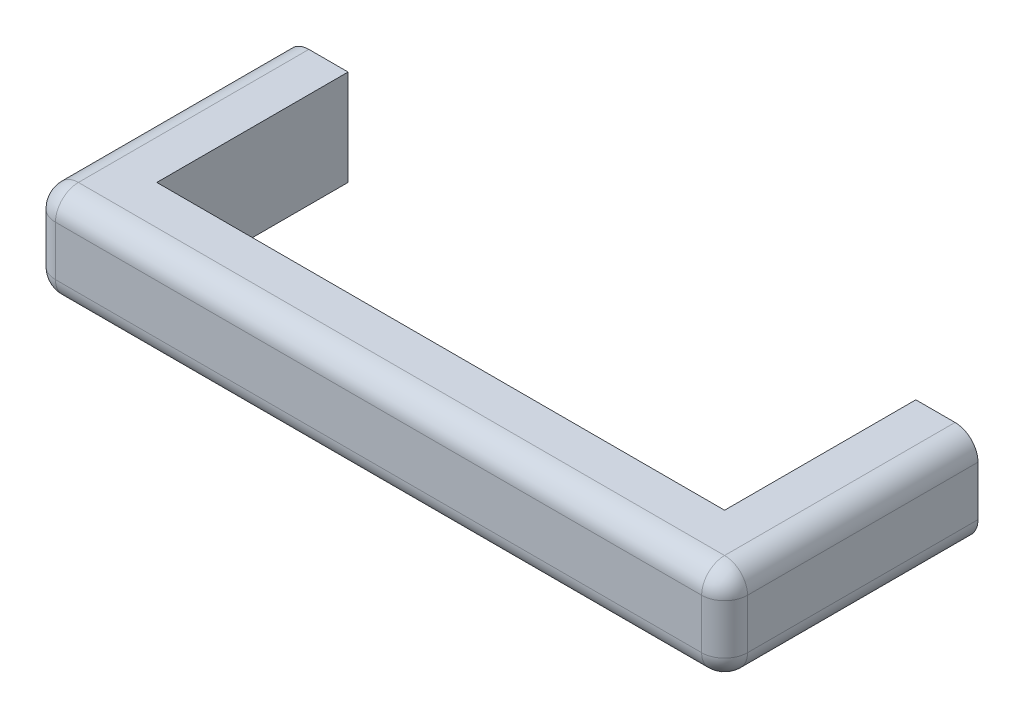
ISO-10303-21;
HEADER;
FILE_DESCRIPTION(('STEP AP214'),'2;1');
FILE_NAME('part.step','',(''),(''),'','','');
FILE_SCHEMA(('AUTOMOTIVE_DESIGN { 1 0 10303 214 1 1 1 1 }'));
ENDSEC;
DATA;
#1=APPLICATION_CONTEXT('core data for automotive mechanical design processes');
#2=APPLICATION_PROTOCOL_DEFINITION('international standard','automotive_design',2000,#1);
#3=PRODUCT_CONTEXT('',#1,'mechanical');
#4=PRODUCT('Part','Part','',(#3));
#5=PRODUCT_RELATED_PRODUCT_CATEGORY('part','',(#4));
#6=PRODUCT_DEFINITION_FORMATION('','',#4);
#7=PRODUCT_DEFINITION_CONTEXT('part definition',#1,'design');
#8=PRODUCT_DEFINITION('design','',#6,#7);
#9=PRODUCT_DEFINITION_SHAPE('','',#8);
#10=(LENGTH_UNIT() NAMED_UNIT(*) SI_UNIT(.MILLI.,.METRE.));
#11=(NAMED_UNIT(*) PLANE_ANGLE_UNIT() SI_UNIT($,.RADIAN.));
#12=(NAMED_UNIT(*) SI_UNIT($,.STERADIAN.) SOLID_ANGLE_UNIT());
#13=UNCERTAINTY_MEASURE_WITH_UNIT(LENGTH_MEASURE(1.E-05),#10,'distance_accuracy_value','');
#14=(GEOMETRIC_REPRESENTATION_CONTEXT(3) GLOBAL_UNCERTAINTY_ASSIGNED_CONTEXT((#13)) GLOBAL_UNIT_ASSIGNED_CONTEXT((#10,
#11,#12)) REPRESENTATION_CONTEXT('',''));
#15=CARTESIAN_POINT('',(0.,0.,0.));
#16=DIRECTION('',(0.,0.,1.));
#17=DIRECTION('',(1.,0.,0.));
#18=AXIS2_PLACEMENT_3D('',#15,#16,#17);
#19=CARTESIAN_POINT('',(376.9999953,-65.0875,-254.));
#20=DIRECTION('',(-1.,0.,0.));
#21=DIRECTION('',(0.,0.,1.));
#22=AXIS2_PLACEMENT_3D('',#19,#20,#21);
#23=PLANE('',#22);
#24=DIRECTION('',(0.,1.,0.));
#25=VECTOR('',#24,1.);
#26=CARTESIAN_POINT('',(376.9999953,-65.0875,-1.38017691961571E-13));
#27=LINE('',#26,#25);
#28=CARTESIAN_POINT('',(376.9999953,-65.0875,-1.38017691961571E-13));
#29=VERTEX_POINT('',#28);
#30=CARTESIAN_POINT('',(376.9999953,61.9125,-1.38017691961571E-13));
#31=VERTEX_POINT('',#30);
#32=EDGE_CURVE('E134',#29,#31,#27,.T.);
#33=ORIENTED_EDGE('',*,*,#32,.T.);
#34=DIRECTION('',(0.,0.,1.));
#35=VECTOR('',#34,1.);
#36=CARTESIAN_POINT('',(376.9999953,61.9125,-254.));
#37=LINE('',#36,#35);
#38=CARTESIAN_POINT('',(376.9999953,61.9125,-254.));
#39=VERTEX_POINT('',#38);
#40=EDGE_CURVE('E138',#39,#31,#37,.T.);
#41=ORIENTED_EDGE('',*,*,#40,.F.);
#42=DIRECTION('',(0.,1.,0.));
#43=VECTOR('',#42,1.);
#44=CARTESIAN_POINT('',(376.9999953,-65.0875,-254.));
#45=LINE('',#44,#43);
#46=CARTESIAN_POINT('',(376.9999953,-65.0875,-254.));
#47=VERTEX_POINT('',#46);
#48=EDGE_CURVE('E176',#47,#39,#45,.T.);
#49=ORIENTED_EDGE('',*,*,#48,.F.);
#50=DIRECTION('',(0.,0.,1.));
#51=VECTOR('',#50,1.);
#52=CARTESIAN_POINT('',(376.9999953,-65.0875,-254.));
#53=LINE('',#52,#51);
#54=EDGE_CURVE('E140',#47,#29,#53,.T.);
#55=ORIENTED_EDGE('',*,*,#54,.T.);
#56=EDGE_LOOP('',(#33,#41,#49,#55));
#57=FACE_BOUND('',#56,.T.);
#58=ADVANCED_FACE('F33',(#57),#23,.T.);
#59=CARTESIAN_POINT('',(459.5499953,-65.0875,-254.));
#60=DIRECTION('',(0.,0.,-1.));
#61=DIRECTION('',(-1.,0.,0.));
#62=AXIS2_PLACEMENT_3D('',#59,#60,#61);
#63=PLANE('',#62);
#64=DIRECTION('',(0.,1.,0.));
#65=VECTOR('',#64,1.);
#66=CARTESIAN_POINT('',(459.5499953,-65.0875,-254.));
#67=LINE('',#66,#65);
#68=CARTESIAN_POINT('',(459.5499953,-34.6075,-254.));
#69=VERTEX_POINT('',#68);
#70=CARTESIAN_POINT('',(459.5499953,31.4325,-254.));
#71=VERTEX_POINT('',#70);
#72=EDGE_CURVE('E179',#69,#71,#67,.T.);
#73=ORIENTED_EDGE('',*,*,#72,.F.);
#74=CARTESIAN_POINT('',(429.0699953,-34.6075,-254.));
#75=DIRECTION('',(0.,0.,-1.));
#76=DIRECTION('',(-1.,0.,0.));
#77=AXIS2_PLACEMENT_3D('',#74,#75,#76);
#78=CIRCLE('',#77,30.48);
#79=CARTESIAN_POINT('',(429.0699953,-65.0875,-254.));
#80=VERTEX_POINT('',#79);
#81=EDGE_CURVE('E211',#69,#80,#78,.T.);
#82=ORIENTED_EDGE('',*,*,#81,.T.);
#83=DIRECTION('',(-1.,0.,0.));
#84=VECTOR('',#83,1.);
#85=CARTESIAN_POINT('',(459.5499953,-65.0875,-254.));
#86=LINE('',#85,#84);
#87=EDGE_CURVE('E145',#80,#47,#86,.T.);
#88=ORIENTED_EDGE('',*,*,#87,.T.);
#89=ORIENTED_EDGE('',*,*,#48,.T.);
#90=DIRECTION('',(-1.,0.,0.));
#91=VECTOR('',#90,1.);
#92=CARTESIAN_POINT('',(459.5499953,61.9125,-254.));
#93=LINE('',#92,#91);
#94=CARTESIAN_POINT('',(429.0699953,61.9125,-254.));
#95=VERTEX_POINT('',#94);
#96=EDGE_CURVE('E156',#95,#39,#93,.T.);
#97=ORIENTED_EDGE('',*,*,#96,.F.);
#98=CARTESIAN_POINT('',(429.0699953,31.4325,-254.));
#99=DIRECTION('',(0.,0.,-1.));
#100=DIRECTION('',(-1.,0.,0.));
#101=AXIS2_PLACEMENT_3D('',#98,#99,#100);
#102=CIRCLE('',#101,30.48);
#103=EDGE_CURVE('E209',#95,#71,#102,.T.);
#104=ORIENTED_EDGE('',*,*,#103,.T.);
#105=EDGE_LOOP('',(#73,#82,#88,#89,#97,#104));
#106=FACE_BOUND('',#105,.T.);
#107=ADVANCED_FACE('F307',(#106),#63,.T.);
#108=CARTESIAN_POINT('',(459.5499953,-65.0875,82.5499999999998));
#109=DIRECTION('',(1.,0.,0.));
#110=DIRECTION('',(0.,0.,-1.));
#111=AXIS2_PLACEMENT_3D('',#108,#109,#110);
#112=PLANE('',#111);
#113=DIRECTION('',(0.,1.,0.));
#114=VECTOR('',#113,1.);
#115=CARTESIAN_POINT('',(459.5499953,-65.0875,52.0699999999998));
#116=LINE('',#115,#114);
#117=CARTESIAN_POINT('',(459.5499953,31.4325,52.0699999999998));
#118=VERTEX_POINT('',#117);
#119=CARTESIAN_POINT('',(459.5499953,-34.6075,52.0699999999998));
#120=VERTEX_POINT('',#119);
#121=EDGE_CURVE('E205',#118,#120,#116,.F.);
#122=ORIENTED_EDGE('',*,*,#121,.T.);
#123=DIRECTION('',(0.,0.,-1.));
#124=VECTOR('',#123,1.);
#125=CARTESIAN_POINT('',(459.5499953,-34.6075,82.5499999999998));
#126=LINE('',#125,#124);
#127=EDGE_CURVE('E207',#120,#69,#126,.T.);
#128=ORIENTED_EDGE('',*,*,#127,.T.);
#129=ORIENTED_EDGE('',*,*,#72,.T.);
#130=DIRECTION('',(0.,0.,-1.));
#131=VECTOR('',#130,1.);
#132=CARTESIAN_POINT('',(459.5499953,31.4325,82.5499999999998));
#133=LINE('',#132,#131);
#134=EDGE_CURVE('E203',#71,#118,#133,.F.);
#135=ORIENTED_EDGE('',*,*,#134,.T.);
#136=EDGE_LOOP('',(#122,#128,#129,#135));
#137=FACE_BOUND('',#136,.T.);
#138=ADVANCED_FACE('F310',(#137),#112,.T.);
#139=CARTESIAN_POINT('',(-459.5499953,-65.0875,82.5500000000001));
#140=DIRECTION('',(0.,0.,1.));
#141=DIRECTION('',(1.,0.,0.));
#142=AXIS2_PLACEMENT_3D('',#139,#140,#141);
#143=PLANE('',#142);
#144=DIRECTION('',(0.,1.,0.));
#145=VECTOR('',#144,1.);
#146=CARTESIAN_POINT('',(-429.0699953,-65.0875,82.5500000000001));
#147=LINE('',#146,#145);
#148=CARTESIAN_POINT('',(-429.0699953,31.4325,82.5500000000001));
#149=VERTEX_POINT('',#148);
#150=CARTESIAN_POINT('',(-429.0699953,-34.6075,82.5500000000001));
#151=VERTEX_POINT('',#150);
#152=EDGE_CURVE('E198',#149,#151,#147,.F.);
#153=ORIENTED_EDGE('',*,*,#152,.T.);
#154=DIRECTION('',(1.,0.,0.));
#155=VECTOR('',#154,1.);
#156=CARTESIAN_POINT('',(-459.5499953,-34.6075,82.5500000000001));
#157=LINE('',#156,#155);
#158=CARTESIAN_POINT('',(429.0699953,-34.6075,82.5499999999999));
#159=VERTEX_POINT('',#158);
#160=EDGE_CURVE('E201',#151,#159,#157,.T.);
#161=ORIENTED_EDGE('',*,*,#160,.T.);
#162=DIRECTION('',(0.,1.,0.));
#163=VECTOR('',#162,1.);
#164=CARTESIAN_POINT('',(429.0699953,-65.0875,82.5499999999999));
#165=LINE('',#164,#163);
#166=CARTESIAN_POINT('',(429.0699953,31.4325,82.5499999999999));
#167=VERTEX_POINT('',#166);
#168=EDGE_CURVE('E196',#159,#167,#165,.T.);
#169=ORIENTED_EDGE('',*,*,#168,.T.);
#170=DIRECTION('',(1.,0.,0.));
#171=VECTOR('',#170,1.);
#172=CARTESIAN_POINT('',(-459.5499953,31.4325,82.5500000000001));
#173=LINE('',#172,#171);
#174=EDGE_CURVE('E194',#167,#149,#173,.F.);
#175=ORIENTED_EDGE('',*,*,#174,.T.);
#176=EDGE_LOOP('',(#153,#161,#169,#175));
#177=FACE_BOUND('',#176,.T.);
#178=ADVANCED_FACE('F272',(#177),#143,.T.);
#179=CARTESIAN_POINT('',(-459.5499953,-65.0875,-254.));
#180=DIRECTION('',(-1.,0.,0.));
#181=DIRECTION('',(0.,0.,1.));
#182=AXIS2_PLACEMENT_3D('',#179,#180,#181);
#183=PLANE('',#182);
#184=DIRECTION('',(0.,1.,0.));
#185=VECTOR('',#184,1.);
#186=CARTESIAN_POINT('',(-459.5499953,-65.0875,-254.));
#187=LINE('',#186,#185);
#188=CARTESIAN_POINT('',(-459.5499953,-34.6075,-254.));
#189=VERTEX_POINT('',#188);
#190=CARTESIAN_POINT('',(-459.5499953,31.4325,-254.));
#191=VERTEX_POINT('',#190);
#192=EDGE_CURVE('E182',#189,#191,#187,.T.);
#193=ORIENTED_EDGE('',*,*,#192,.F.);
#194=DIRECTION('',(0.,0.,1.));
#195=VECTOR('',#194,1.);
#196=CARTESIAN_POINT('',(-459.5499953,-34.6075,-254.));
#197=LINE('',#196,#195);
#198=CARTESIAN_POINT('',(-459.5499953,-34.6075,52.0700000000001));
#199=VERTEX_POINT('',#198);
#200=EDGE_CURVE('E192',#189,#199,#197,.T.);
#201=ORIENTED_EDGE('',*,*,#200,.T.);
#202=DIRECTION('',(0.,1.,0.));
#203=VECTOR('',#202,1.);
#204=CARTESIAN_POINT('',(-459.5499953,-65.0875,52.0700000000001));
#205=LINE('',#204,#203);
#206=CARTESIAN_POINT('',(-459.5499953,31.4325,52.0700000000001));
#207=VERTEX_POINT('',#206);
#208=EDGE_CURVE('E189',#199,#207,#205,.T.);
#209=ORIENTED_EDGE('',*,*,#208,.T.);
#210=DIRECTION('',(0.,0.,1.));
#211=VECTOR('',#210,1.);
#212=CARTESIAN_POINT('',(-459.5499953,31.4325,-254.));
#213=LINE('',#212,#211);
#214=EDGE_CURVE('E178',#207,#191,#213,.F.);
#215=ORIENTED_EDGE('',*,*,#214,.T.);
#216=EDGE_LOOP('',(#193,#201,#209,#215));
#217=FACE_BOUND('',#216,.T.);
#218=ADVANCED_FACE('F296',(#217),#183,.T.);
#219=CARTESIAN_POINT('',(-376.9999953,-65.0875,-254.));
#220=DIRECTION('',(0.,0.,-1.));
#221=DIRECTION('',(-1.,0.,0.));
#222=AXIS2_PLACEMENT_3D('',#219,#220,#221);
#223=PLANE('',#222);
#224=DIRECTION('',(-1.,0.,0.));
#225=VECTOR('',#224,1.);
#226=CARTESIAN_POINT('',(-376.9999953,-65.0875,-254.));
#227=LINE('',#226,#225);
#228=CARTESIAN_POINT('',(-376.9999953,-65.0875,-254.));
#229=VERTEX_POINT('',#228);
#230=CARTESIAN_POINT('',(-429.0699953,-65.0875,-254.));
#231=VERTEX_POINT('',#230);
#232=EDGE_CURVE('E172',#229,#231,#227,.T.);
#233=ORIENTED_EDGE('',*,*,#232,.T.);
#234=CARTESIAN_POINT('',(-429.0699953,-34.6075,-254.));
#235=DIRECTION('',(0.,0.,-1.));
#236=DIRECTION('',(-1.,0.,0.));
#237=AXIS2_PLACEMENT_3D('',#234,#235,#236);
#238=CIRCLE('',#237,30.48);
#239=EDGE_CURVE('E11',#231,#189,#238,.T.);
#240=ORIENTED_EDGE('',*,*,#239,.T.);
#241=ORIENTED_EDGE('',*,*,#192,.T.);
#242=CARTESIAN_POINT('',(-429.0699953,31.4325,-254.));
#243=DIRECTION('',(0.,0.,-1.));
#244=DIRECTION('',(-1.,0.,0.));
#245=AXIS2_PLACEMENT_3D('',#242,#243,#244);
#246=CIRCLE('',#245,30.48);
#247=CARTESIAN_POINT('',(-429.0699953,61.9125,-254.));
#248=VERTEX_POINT('',#247);
#249=EDGE_CURVE('E42',#191,#248,#246,.T.);
#250=ORIENTED_EDGE('',*,*,#249,.T.);
#251=DIRECTION('',(-1.,0.,0.));
#252=VECTOR('',#251,1.);
#253=CARTESIAN_POINT('',(-376.9999953,61.9125,-254.));
#254=LINE('',#253,#252);
#255=CARTESIAN_POINT('',(-376.9999953,61.9125,-254.));
#256=VERTEX_POINT('',#255);
#257=EDGE_CURVE('E163',#256,#248,#254,.T.);
#258=ORIENTED_EDGE('',*,*,#257,.F.);
#259=DIRECTION('',(0.,1.,0.));
#260=VECTOR('',#259,1.);
#261=CARTESIAN_POINT('',(-376.9999953,-65.0875,-254.));
#262=LINE('',#261,#260);
#263=EDGE_CURVE('E185',#229,#256,#262,.T.);
#264=ORIENTED_EDGE('',*,*,#263,.F.);
#265=EDGE_LOOP('',(#233,#240,#241,#250,#258,#264));
#266=FACE_BOUND('',#265,.T.);
#267=ADVANCED_FACE('F293',(#266),#223,.T.);
#268=CARTESIAN_POINT('',(-376.9999953,-65.0875,0.));
#269=DIRECTION('',(1.,0.,0.));
#270=DIRECTION('',(0.,0.,-1.));
#271=AXIS2_PLACEMENT_3D('',#268,#269,#270);
#272=PLANE('',#271);
#273=ORIENTED_EDGE('',*,*,#263,.T.);
#274=DIRECTION('',(0.,0.,-1.));
#275=VECTOR('',#274,1.);
#276=CARTESIAN_POINT('',(-376.9999953,61.9125,0.));
#277=LINE('',#276,#275);
#278=CARTESIAN_POINT('',(-376.9999953,61.9125,0.));
#279=VERTEX_POINT('',#278);
#280=EDGE_CURVE('E152',#279,#256,#277,.T.);
#281=ORIENTED_EDGE('',*,*,#280,.F.);
#282=DIRECTION('',(0.,1.,0.));
#283=VECTOR('',#282,1.);
#284=CARTESIAN_POINT('',(-376.9999953,-65.0875,0.));
#285=LINE('',#284,#283);
#286=CARTESIAN_POINT('',(-376.9999953,-65.0875,0.));
#287=VERTEX_POINT('',#286);
#288=EDGE_CURVE('E144',#287,#279,#285,.T.);
#289=ORIENTED_EDGE('',*,*,#288,.F.);
#290=DIRECTION('',(0.,0.,-1.));
#291=VECTOR('',#290,1.);
#292=CARTESIAN_POINT('',(-376.9999953,-65.0875,0.));
#293=LINE('',#292,#291);
#294=EDGE_CURVE('E169',#287,#229,#293,.T.);
#295=ORIENTED_EDGE('',*,*,#294,.T.);
#296=EDGE_LOOP('',(#273,#281,#289,#295));
#297=FACE_BOUND('',#296,.T.);
#298=ADVANCED_FACE('F304',(#297),#272,.T.);
#299=CARTESIAN_POINT('',(376.9999953,-65.0875,-1.38017691961571E-13));
#300=DIRECTION('',(0.,0.,-1.));
#301=DIRECTION('',(-1.,0.,0.));
#302=AXIS2_PLACEMENT_3D('',#299,#300,#301);
#303=PLANE('',#302);
#304=ORIENTED_EDGE('',*,*,#288,.T.);
#305=DIRECTION('',(-1.,0.,0.));
#306=VECTOR('',#305,1.);
#307=CARTESIAN_POINT('',(376.9999953,61.9125,-1.38017691961571E-13));
#308=LINE('',#307,#306);
#309=EDGE_CURVE('E148',#31,#279,#308,.T.);
#310=ORIENTED_EDGE('',*,*,#309,.F.);
#311=ORIENTED_EDGE('',*,*,#32,.F.);
#312=DIRECTION('',(-1.,0.,0.));
#313=VECTOR('',#312,1.);
#314=CARTESIAN_POINT('',(376.9999953,-65.0875,-1.38017691961571E-13));
#315=LINE('',#314,#313);
#316=EDGE_CURVE('E167',#29,#287,#315,.T.);
#317=ORIENTED_EDGE('',*,*,#316,.T.);
#318=EDGE_LOOP('',(#304,#310,#311,#317));
#319=FACE_BOUND('',#318,.T.);
#320=ADVANCED_FACE('F149',(#319),#303,.T.);
#321=CARTESIAN_POINT('',(0.,-65.0875,0.));
#322=DIRECTION('',(0.,-1.,0.));
#323=DIRECTION('',(0.,0.,-1.));
#324=AXIS2_PLACEMENT_3D('',#321,#322,#323);
#325=PLANE('',#324);
#326=ORIENTED_EDGE('',*,*,#87,.F.);
#327=DIRECTION('',(0.,0.,-1.));
#328=VECTOR('',#327,1.);
#329=CARTESIAN_POINT('',(429.0699953,-65.0875,0.));
#330=LINE('',#329,#328);
#331=CARTESIAN_POINT('',(429.0699953,-65.0875,52.0699999999998));
#332=VERTEX_POINT('',#331);
#333=EDGE_CURVE('E217',#80,#332,#330,.F.);
#334=ORIENTED_EDGE('',*,*,#333,.T.);
#335=DIRECTION('',(1.,0.,0.));
#336=VECTOR('',#335,1.);
#337=CARTESIAN_POINT('',(0.,-65.0875,52.07));
#338=LINE('',#337,#336);
#339=CARTESIAN_POINT('',(-429.0699953,-65.0875,52.0700000000001));
#340=VERTEX_POINT('',#339);
#341=EDGE_CURVE('E213',#332,#340,#338,.F.);
#342=ORIENTED_EDGE('',*,*,#341,.T.);
#343=DIRECTION('',(0.,0.,1.));
#344=VECTOR('',#343,1.);
#345=CARTESIAN_POINT('',(-429.0699953,-65.0875,0.));
#346=LINE('',#345,#344);
#347=EDGE_CURVE('E215',#340,#231,#346,.F.);
#348=ORIENTED_EDGE('',*,*,#347,.T.);
#349=ORIENTED_EDGE('',*,*,#232,.F.);
#350=ORIENTED_EDGE('',*,*,#294,.F.);
#351=ORIENTED_EDGE('',*,*,#316,.F.);
#352=ORIENTED_EDGE('',*,*,#54,.F.);
#353=EDGE_LOOP('',(#326,#334,#342,#348,#349,#350,#351,#352));
#354=FACE_BOUND('',#353,.T.);
#355=ADVANCED_FACE('F283',(#354),#325,.T.);
#356=CARTESIAN_POINT('',(0.,61.9125,0.));
#357=DIRECTION('',(0.,-1.,0.));
#358=DIRECTION('',(0.,0.,-1.));
#359=AXIS2_PLACEMENT_3D('',#356,#357,#358);
#360=PLANE('',#359);
#361=DIRECTION('',(1.,0.,0.));
#362=VECTOR('',#361,1.);
#363=CARTESIAN_POINT('',(459.5499953,61.9125,52.0699999999998));
#364=LINE('',#363,#362);
#365=CARTESIAN_POINT('',(-429.0699953,61.9125,52.0700000000001));
#366=VERTEX_POINT('',#365);
#367=CARTESIAN_POINT('',(429.0699953,61.9125,52.0699999999998));
#368=VERTEX_POINT('',#367);
#369=EDGE_CURVE('E50',#366,#368,#364,.T.);
#370=ORIENTED_EDGE('',*,*,#369,.T.);
#371=DIRECTION('',(0.,0.,-1.));
#372=VECTOR('',#371,1.);
#373=CARTESIAN_POINT('',(429.0699953,61.9125,-254.));
#374=LINE('',#373,#372);
#375=EDGE_CURVE('E221',#368,#95,#374,.T.);
#376=ORIENTED_EDGE('',*,*,#375,.T.);
#377=ORIENTED_EDGE('',*,*,#96,.T.);
#378=ORIENTED_EDGE('',*,*,#40,.T.);
#379=ORIENTED_EDGE('',*,*,#309,.T.);
#380=ORIENTED_EDGE('',*,*,#280,.T.);
#381=ORIENTED_EDGE('',*,*,#257,.T.);
#382=DIRECTION('',(0.,0.,1.));
#383=VECTOR('',#382,1.);
#384=CARTESIAN_POINT('',(-429.0699953,61.9125,82.5500000000001));
#385=LINE('',#384,#383);
#386=EDGE_CURVE('E55',#248,#366,#385,.T.);
#387=ORIENTED_EDGE('',*,*,#386,.T.);
#388=EDGE_LOOP('',(#370,#376,#377,#378,#379,#380,#381,#387));
#389=FACE_BOUND('',#388,.T.);
#390=ADVANCED_FACE('F154',(#389),#360,.F.);
#391=CARTESIAN_POINT('',(429.0699953,-34.6075,82.5499999999998));
#392=DIRECTION('',(0.,0.,-1.));
#393=DIRECTION('',(-1.,0.,0.));
#394=AXIS2_PLACEMENT_3D('',#391,#392,#393);
#395=CYLINDRICAL_SURFACE('',#394,30.48);
#396=ORIENTED_EDGE('',*,*,#81,.F.);
#397=ORIENTED_EDGE('',*,*,#127,.F.);
#398=CARTESIAN_POINT('',(429.0699953,-34.6075,52.0699999999998));
#399=DIRECTION('',(0.,0.,1.));
#400=DIRECTION('',(1.,0.,0.));
#401=AXIS2_PLACEMENT_3D('',#398,#399,#400);
#402=CIRCLE('',#401,30.48);
#403=EDGE_CURVE('E160',#332,#120,#402,.T.);
#404=ORIENTED_EDGE('',*,*,#403,.F.);
#405=ORIENTED_EDGE('',*,*,#333,.F.);
#406=EDGE_LOOP('',(#396,#397,#404,#405));
#407=FACE_BOUND('',#406,.T.);
#408=ADVANCED_FACE('F35',(#407),#395,.T.);
#409=CARTESIAN_POINT('',(429.0699953,31.4325,0.));
#410=DIRECTION('',(0.,0.,1.));
#411=DIRECTION('',(1.,0.,0.));
#412=AXIS2_PLACEMENT_3D('',#409,#410,#411);
#413=CYLINDRICAL_SURFACE('',#412,30.48);
#414=ORIENTED_EDGE('',*,*,#103,.F.);
#415=ORIENTED_EDGE('',*,*,#375,.F.);
#416=CARTESIAN_POINT('',(429.0699953,31.4325,52.0699999999998));
#417=DIRECTION('',(0.,0.,1.));
#418=DIRECTION('',(1.,0.,0.));
#419=AXIS2_PLACEMENT_3D('',#416,#417,#418);
#420=CIRCLE('',#419,30.48);
#421=EDGE_CURVE('E249',#118,#368,#420,.T.);
#422=ORIENTED_EDGE('',*,*,#421,.F.);
#423=ORIENTED_EDGE('',*,*,#134,.F.);
#424=EDGE_LOOP('',(#414,#415,#422,#423));
#425=FACE_BOUND('',#424,.T.);
#426=ADVANCED_FACE('F312',(#425),#413,.T.);
#427=CARTESIAN_POINT('',(429.0699953,-65.0875,52.0699999999998));
#428=DIRECTION('',(0.,1.,0.));
#429=DIRECTION('',(0.,0.,1.));
#430=AXIS2_PLACEMENT_3D('',#427,#428,#429);
#431=CYLINDRICAL_SURFACE('',#430,30.48);
#432=CARTESIAN_POINT('',(429.0699953,-34.6075,52.0699999999998));
#433=DIRECTION('',(0.,-1.,0.));
#434=DIRECTION('',(0.,0.,-1.));
#435=AXIS2_PLACEMENT_3D('',#432,#433,#434);
#436=CIRCLE('',#435,30.48);
#437=EDGE_CURVE('E37',#120,#159,#436,.T.);
#438=ORIENTED_EDGE('',*,*,#437,.F.);
#439=ORIENTED_EDGE('',*,*,#121,.F.);
#440=CARTESIAN_POINT('',(429.0699953,31.4325,52.0699999999999));
#441=DIRECTION('',(0.,1.,0.));
#442=DIRECTION('',(0.,0.,1.));
#443=AXIS2_PLACEMENT_3D('',#440,#441,#442);
#444=CIRCLE('',#443,30.48);
#445=EDGE_CURVE('E246',#167,#118,#444,.T.);
#446=ORIENTED_EDGE('',*,*,#445,.F.);
#447=ORIENTED_EDGE('',*,*,#168,.F.);
#448=EDGE_LOOP('',(#438,#439,#446,#447));
#449=FACE_BOUND('',#448,.T.);
#450=ADVANCED_FACE('F267',(#449),#431,.T.);
#451=CARTESIAN_POINT('',(429.0699953,-34.6075,52.0699999999998));
#452=DIRECTION('',(1.,0.,0.));
#453=DIRECTION('',(0.,0.,-1.));
#454=AXIS2_PLACEMENT_3D('',#451,#452,#453);
#455=SPHERICAL_SURFACE('',#454,30.48);
#456=ORIENTED_EDGE('',*,*,#403,.T.);
#457=ORIENTED_EDGE('',*,*,#437,.T.);
#458=CARTESIAN_POINT('',(429.0699953,-34.6075,52.0699999999999));
#459=DIRECTION('',(1.,0.,0.));
#460=DIRECTION('',(0.,1.,0.));
#461=AXIS2_PLACEMENT_3D('',#458,#459,#460);
#462=CIRCLE('',#461,30.48);
#463=EDGE_CURVE('E243',#332,#159,#462,.F.);
#464=ORIENTED_EDGE('',*,*,#463,.F.);
#465=EDGE_LOOP('',(#456,#457,#464));
#466=FACE_BOUND('',#465,.T.);
#467=ADVANCED_FACE('F255',(#466),#455,.T.);
#468=CARTESIAN_POINT('',(429.0699953,31.4325,52.0699999999998));
#469=DIRECTION('',(1.,0.,0.));
#470=DIRECTION('',(0.,0.,-1.));
#471=AXIS2_PLACEMENT_3D('',#468,#469,#470);
#472=SPHERICAL_SURFACE('',#471,30.48);
#473=ORIENTED_EDGE('',*,*,#445,.T.);
#474=ORIENTED_EDGE('',*,*,#421,.T.);
#475=CARTESIAN_POINT('',(429.0699953,31.4325,52.0699999999998));
#476=DIRECTION('',(1.,0.,0.));
#477=DIRECTION('',(0.,0.,-1.));
#478=AXIS2_PLACEMENT_3D('',#475,#476,#477);
#479=CIRCLE('',#478,30.48);
#480=EDGE_CURVE('E240',#167,#368,#479,.F.);
#481=ORIENTED_EDGE('',*,*,#480,.F.);
#482=EDGE_LOOP('',(#473,#474,#481));
#483=FACE_BOUND('',#482,.T.);
#484=ADVANCED_FACE('F314',(#483),#472,.T.);
#485=CARTESIAN_POINT('',(-459.5499953,-34.6075,52.0700000000001));
#486=DIRECTION('',(1.,0.,0.));
#487=DIRECTION('',(0.,0.,-1.));
#488=AXIS2_PLACEMENT_3D('',#485,#486,#487);
#489=CYLINDRICAL_SURFACE('',#488,30.48);
#490=ORIENTED_EDGE('',*,*,#463,.T.);
#491=ORIENTED_EDGE('',*,*,#160,.F.);
#492=CARTESIAN_POINT('',(-429.0699953,-34.6075,52.0700000000001));
#493=DIRECTION('',(-1.,0.,0.));
#494=DIRECTION('',(0.,0.,1.));
#495=AXIS2_PLACEMENT_3D('',#492,#493,#494);
#496=CIRCLE('',#495,30.48);
#497=EDGE_CURVE('E237',#340,#151,#496,.T.);
#498=ORIENTED_EDGE('',*,*,#497,.F.);
#499=ORIENTED_EDGE('',*,*,#341,.F.);
#500=EDGE_LOOP('',(#490,#491,#498,#499));
#501=FACE_BOUND('',#500,.T.);
#502=ADVANCED_FACE('F279',(#501),#489,.T.);
#503=CARTESIAN_POINT('',(-429.0699953,-34.6075,-254.));
#504=DIRECTION('',(0.,0.,1.));
#505=DIRECTION('',(1.,0.,0.));
#506=AXIS2_PLACEMENT_3D('',#503,#504,#505);
#507=CYLINDRICAL_SURFACE('',#506,30.48);
#508=ORIENTED_EDGE('',*,*,#239,.F.);
#509=ORIENTED_EDGE('',*,*,#347,.F.);
#510=CARTESIAN_POINT('',(-429.0699953,-34.6075,52.0700000000001));
#511=DIRECTION('',(0.,0.,1.));
#512=DIRECTION('',(1.,0.,0.));
#513=AXIS2_PLACEMENT_3D('',#510,#511,#512);
#514=CIRCLE('',#513,30.48);
#515=EDGE_CURVE('E234',#199,#340,#514,.T.);
#516=ORIENTED_EDGE('',*,*,#515,.F.);
#517=ORIENTED_EDGE('',*,*,#200,.F.);
#518=EDGE_LOOP('',(#508,#509,#516,#517));
#519=FACE_BOUND('',#518,.T.);
#520=ADVANCED_FACE('F288',(#519),#507,.T.);
#521=CARTESIAN_POINT('',(-429.0699953,31.4325,0.));
#522=DIRECTION('',(0.,0.,-1.));
#523=DIRECTION('',(-1.,0.,0.));
#524=AXIS2_PLACEMENT_3D('',#521,#522,#523);
#525=CYLINDRICAL_SURFACE('',#524,30.48);
#526=ORIENTED_EDGE('',*,*,#249,.F.);
#527=ORIENTED_EDGE('',*,*,#214,.F.);
#528=CARTESIAN_POINT('',(-429.0699953,31.4325,52.0700000000001));
#529=DIRECTION('',(0.,0.,1.));
#530=DIRECTION('',(1.,0.,0.));
#531=AXIS2_PLACEMENT_3D('',#528,#529,#530);
#532=CIRCLE('',#531,30.48);
#533=EDGE_CURVE('E231',#366,#207,#532,.T.);
#534=ORIENTED_EDGE('',*,*,#533,.F.);
#535=ORIENTED_EDGE('',*,*,#386,.F.);
#536=EDGE_LOOP('',(#526,#527,#534,#535));
#537=FACE_BOUND('',#536,.T.);
#538=ADVANCED_FACE('F301',(#537),#525,.T.);
#539=CARTESIAN_POINT('',(0.,31.4325,52.07));
#540=DIRECTION('',(-1.,0.,0.));
#541=DIRECTION('',(0.,0.,1.));
#542=AXIS2_PLACEMENT_3D('',#539,#540,#541);
#543=CYLINDRICAL_SURFACE('',#542,30.48);
#544=ORIENTED_EDGE('',*,*,#480,.T.);
#545=ORIENTED_EDGE('',*,*,#369,.F.);
#546=CARTESIAN_POINT('',(-429.0699953,31.4325,52.0700000000001));
#547=DIRECTION('',(-1.,0.,0.));
#548=DIRECTION('',(0.,0.,1.));
#549=AXIS2_PLACEMENT_3D('',#546,#547,#548);
#550=CIRCLE('',#549,30.48);
#551=EDGE_CURVE('E228',#149,#366,#550,.T.);
#552=ORIENTED_EDGE('',*,*,#551,.F.);
#553=ORIENTED_EDGE('',*,*,#174,.F.);
#554=EDGE_LOOP('',(#544,#545,#552,#553));
#555=FACE_BOUND('',#554,.T.);
#556=ADVANCED_FACE('F316',(#555),#543,.T.);
#557=CARTESIAN_POINT('',(-429.0699953,-34.6075,52.0700000000001));
#558=DIRECTION('',(0.,-1.,0.));
#559=DIRECTION('',(0.,0.,-1.));
#560=AXIS2_PLACEMENT_3D('',#557,#558,#559);
#561=SPHERICAL_SURFACE('',#560,30.48);
#562=ORIENTED_EDGE('',*,*,#515,.T.);
#563=ORIENTED_EDGE('',*,*,#497,.T.);
#564=CARTESIAN_POINT('',(-429.0699953,-34.6075,52.0700000000001));
#565=DIRECTION('',(0.,-1.,0.));
#566=DIRECTION('',(0.,0.,-1.));
#567=AXIS2_PLACEMENT_3D('',#564,#565,#566);
#568=CIRCLE('',#567,30.48);
#569=EDGE_CURVE('E226',#199,#151,#568,.F.);
#570=ORIENTED_EDGE('',*,*,#569,.F.);
#571=EDGE_LOOP('',(#562,#563,#570));
#572=FACE_BOUND('',#571,.T.);
#573=ADVANCED_FACE('F323',(#572),#561,.T.);
#574=CARTESIAN_POINT('',(-429.0699953,31.4325,52.0700000000001));
#575=DIRECTION('',(0.,1.,0.));
#576=DIRECTION('',(0.,0.,1.));
#577=AXIS2_PLACEMENT_3D('',#574,#575,#576);
#578=SPHERICAL_SURFACE('',#577,30.48);
#579=ORIENTED_EDGE('',*,*,#551,.T.);
#580=ORIENTED_EDGE('',*,*,#533,.T.);
#581=CARTESIAN_POINT('',(-429.0699953,31.4325,52.0700000000001));
#582=DIRECTION('',(0.,1.,0.));
#583=DIRECTION('',(0.,0.,1.));
#584=AXIS2_PLACEMENT_3D('',#581,#582,#583);
#585=CIRCLE('',#584,30.48);
#586=EDGE_CURVE('E224',#149,#207,#585,.F.);
#587=ORIENTED_EDGE('',*,*,#586,.F.);
#588=EDGE_LOOP('',(#579,#580,#587));
#589=FACE_BOUND('',#588,.T.);
#590=ADVANCED_FACE('F321',(#589),#578,.T.);
#591=CARTESIAN_POINT('',(-429.0699953,-65.0875,52.0700000000001));
#592=DIRECTION('',(0.,1.,0.));
#593=DIRECTION('',(0.,0.,1.));
#594=AXIS2_PLACEMENT_3D('',#591,#592,#593);
#595=CYLINDRICAL_SURFACE('',#594,30.48);
#596=ORIENTED_EDGE('',*,*,#569,.T.);
#597=ORIENTED_EDGE('',*,*,#152,.F.);
#598=ORIENTED_EDGE('',*,*,#586,.T.);
#599=ORIENTED_EDGE('',*,*,#208,.F.);
#600=EDGE_LOOP('',(#596,#597,#598,#599));
#601=FACE_BOUND('',#600,.T.);
#602=ADVANCED_FACE('F320',(#601),#595,.T.);
#603=CLOSED_SHELL('',(#58,#107,#138,#178,#218,#267,#298,#320,#355,#390,#408,#426,#450,#467,#484,
#502,#520,#538,#556,#573,#590,#602));
#604=MANIFOLD_SOLID_BREP('B2',#603);
#605=ADVANCED_BREP_SHAPE_REPRESENTATION('',(#18,#604),#14);
#606=SHAPE_DEFINITION_REPRESENTATION(#9,#605);
ENDSEC;
END-ISO-10303-21;
